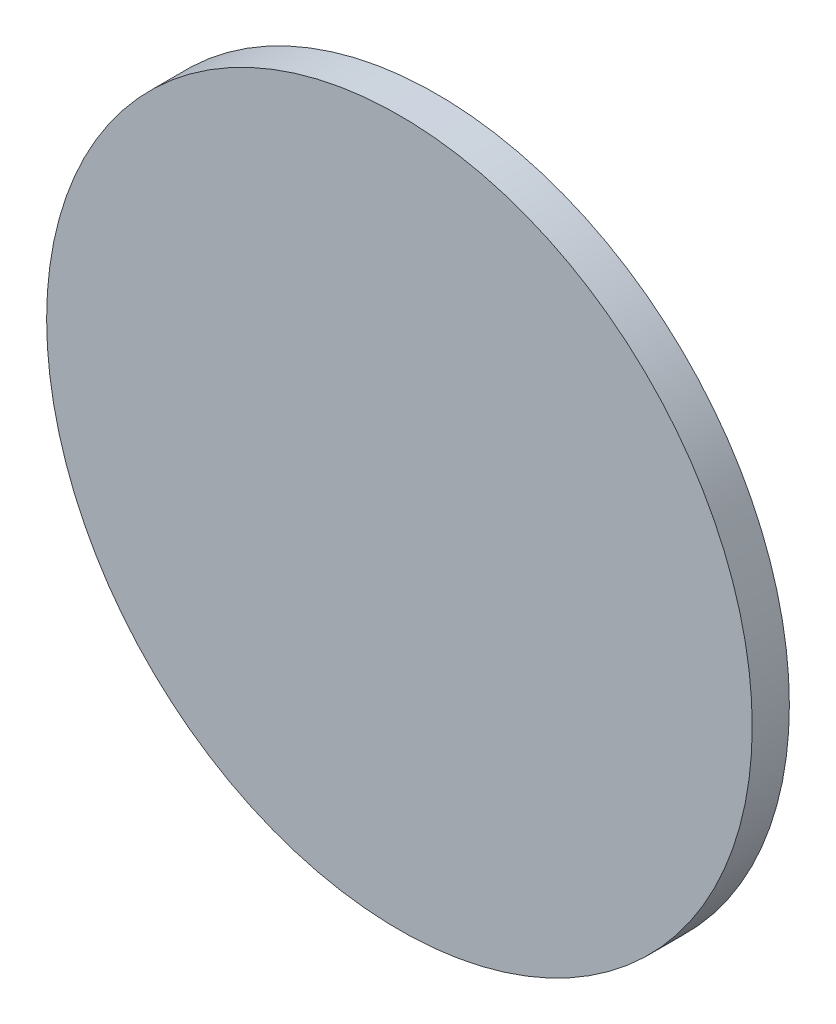
ISO-10303-21;
HEADER;
FILE_DESCRIPTION(('STEP AP214'),'2;1');
FILE_NAME('part.step','',(''),(''),'','','');
FILE_SCHEMA(('AUTOMOTIVE_DESIGN { 1 0 10303 214 1 1 1 1 }'));
ENDSEC;
DATA;
#1=APPLICATION_CONTEXT('core data for automotive mechanical design processes');
#2=APPLICATION_PROTOCOL_DEFINITION('international standard','automotive_design',2000,#1);
#3=PRODUCT_CONTEXT('',#1,'mechanical');
#4=PRODUCT('Part','Part','',(#3));
#5=PRODUCT_RELATED_PRODUCT_CATEGORY('part','',(#4));
#6=PRODUCT_DEFINITION_FORMATION('','',#4);
#7=PRODUCT_DEFINITION_CONTEXT('part definition',#1,'design');
#8=PRODUCT_DEFINITION('design','',#6,#7);
#9=PRODUCT_DEFINITION_SHAPE('','',#8);
#10=(LENGTH_UNIT() NAMED_UNIT(*) SI_UNIT(.MILLI.,.METRE.));
#11=(NAMED_UNIT(*) PLANE_ANGLE_UNIT() SI_UNIT($,.RADIAN.));
#12=(NAMED_UNIT(*) SI_UNIT($,.STERADIAN.) SOLID_ANGLE_UNIT());
#13=UNCERTAINTY_MEASURE_WITH_UNIT(LENGTH_MEASURE(1.E-05),#10,'distance_accuracy_value','');
#14=(GEOMETRIC_REPRESENTATION_CONTEXT(3) GLOBAL_UNCERTAINTY_ASSIGNED_CONTEXT((#13)) GLOBAL_UNIT_ASSIGNED_CONTEXT((#10,
#11,#12)) REPRESENTATION_CONTEXT('',''));
#15=CARTESIAN_POINT('',(0.,0.,0.));
#16=DIRECTION('',(0.,0.,1.));
#17=DIRECTION('',(1.,0.,0.));
#18=AXIS2_PLACEMENT_3D('',#15,#16,#17);
#19=CARTESIAN_POINT('',(0.,0.,2.));
#20=DIRECTION('',(0.,0.,-1.));
#21=DIRECTION('',(-1.,0.,0.));
#22=AXIS2_PLACEMENT_3D('',#19,#20,#21);
#23=CYLINDRICAL_SURFACE('',#22,19.);
#24=CARTESIAN_POINT('',(0.,0.,2.));
#25=DIRECTION('',(0.,0.,1.));
#26=DIRECTION('',(1.,0.,0.));
#27=AXIS2_PLACEMENT_3D('',#24,#25,#26);
#28=CIRCLE('',#27,19.);
#29=CARTESIAN_POINT('',(19.,0.,2.));
#30=VERTEX_POINT('',#29);
#31=EDGE_CURVE('E10',#30,#30,#28,.T.);
#32=ORIENTED_EDGE('',*,*,#31,.F.);
#33=EDGE_LOOP('',(#32));
#34=FACE_BOUND('',#33,.T.);
#35=CARTESIAN_POINT('',(0.,0.,0.));
#36=DIRECTION('',(0.,0.,1.));
#37=DIRECTION('',(1.,0.,0.));
#38=AXIS2_PLACEMENT_3D('',#35,#36,#37);
#39=CIRCLE('',#38,19.);
#40=CARTESIAN_POINT('',(19.,0.,0.));
#41=VERTEX_POINT('',#40);
#42=EDGE_CURVE('E32',#41,#41,#39,.T.);
#43=ORIENTED_EDGE('',*,*,#42,.T.);
#44=EDGE_LOOP('',(#43));
#45=FACE_BOUND('',#44,.T.);
#46=ADVANCED_FACE('F29',(#34,#45),#23,.T.);
#47=CARTESIAN_POINT('',(0.,0.,2.));
#48=DIRECTION('',(0.,0.,1.));
#49=DIRECTION('',(1.,0.,0.));
#50=AXIS2_PLACEMENT_3D('',#47,#48,#49);
#51=PLANE('',#50);
#52=ORIENTED_EDGE('',*,*,#31,.T.);
#53=EDGE_LOOP('',(#52));
#54=FACE_BOUND('',#53,.T.);
#55=ADVANCED_FACE('F44',(#54),#51,.T.);
#56=CARTESIAN_POINT('',(0.,0.,0.));
#57=DIRECTION('',(0.,0.,1.));
#58=DIRECTION('',(1.,0.,0.));
#59=AXIS2_PLACEMENT_3D('',#56,#57,#58);
#60=PLANE('',#59);
#61=ORIENTED_EDGE('',*,*,#42,.F.);
#62=EDGE_LOOP('',(#61));
#63=FACE_BOUND('',#62,.T.);
#64=ADVANCED_FACE('F42',(#63),#60,.F.);
#65=CLOSED_SHELL('',(#46,#55,#64));
#66=MANIFOLD_SOLID_BREP('B2',#65);
#67=ADVANCED_BREP_SHAPE_REPRESENTATION('',(#18,#66),#14);
#68=SHAPE_DEFINITION_REPRESENTATION(#9,#67);
ENDSEC;
END-ISO-10303-21;
